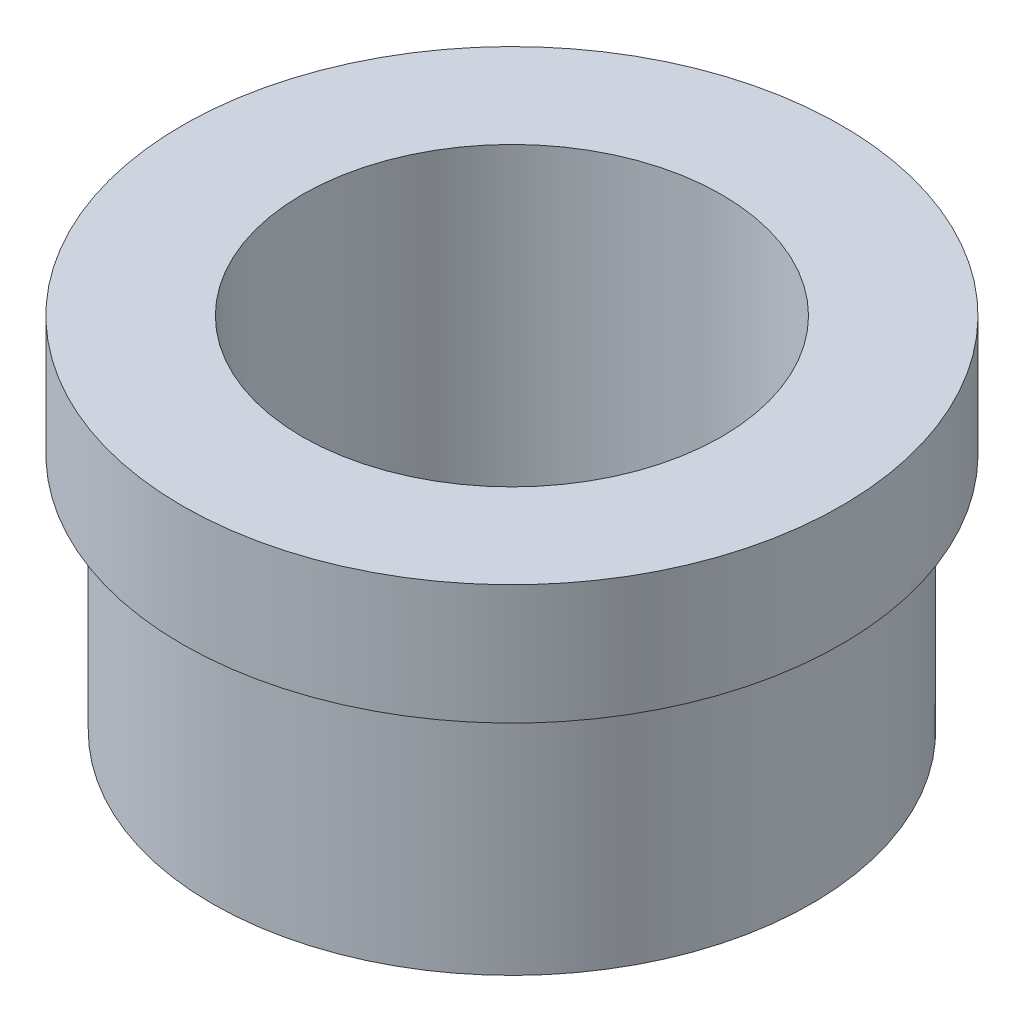
ISO-10303-21;
HEADER;
FILE_DESCRIPTION(('STEP AP214'),'2;1');
FILE_NAME('part.step','',(''),(''),'','','');
FILE_SCHEMA(('AUTOMOTIVE_DESIGN { 1 0 10303 214 1 1 1 1 }'));
ENDSEC;
DATA;
#1=APPLICATION_CONTEXT('core data for automotive mechanical design processes');
#2=APPLICATION_PROTOCOL_DEFINITION('international standard','automotive_design',2000,#1);
#3=PRODUCT_CONTEXT('',#1,'mechanical');
#4=PRODUCT('Part','Part','',(#3));
#5=PRODUCT_RELATED_PRODUCT_CATEGORY('part','',(#4));
#6=PRODUCT_DEFINITION_FORMATION('','',#4);
#7=PRODUCT_DEFINITION_CONTEXT('part definition',#1,'design');
#8=PRODUCT_DEFINITION('design','',#6,#7);
#9=PRODUCT_DEFINITION_SHAPE('','',#8);
#10=(LENGTH_UNIT() NAMED_UNIT(*) SI_UNIT(.MILLI.,.METRE.));
#11=(NAMED_UNIT(*) PLANE_ANGLE_UNIT() SI_UNIT($,.RADIAN.));
#12=(NAMED_UNIT(*) SI_UNIT($,.STERADIAN.) SOLID_ANGLE_UNIT());
#13=UNCERTAINTY_MEASURE_WITH_UNIT(LENGTH_MEASURE(1.E-05),#10,'distance_accuracy_value','');
#14=(GEOMETRIC_REPRESENTATION_CONTEXT(3) GLOBAL_UNCERTAINTY_ASSIGNED_CONTEXT((#13)) GLOBAL_UNIT_ASSIGNED_CONTEXT((#10,
#11,#12)) REPRESENTATION_CONTEXT('',''));
#15=CARTESIAN_POINT('',(0.,0.,0.));
#16=DIRECTION('',(0.,0.,1.));
#17=DIRECTION('',(1.,0.,0.));
#18=AXIS2_PLACEMENT_3D('',#15,#16,#17);
#19=CARTESIAN_POINT('',(0.,0.,0.));
#20=DIRECTION('',(0.,1.,0.));
#21=DIRECTION('',(0.,0.,1.));
#22=AXIS2_PLACEMENT_3D('',#19,#20,#21);
#23=PLANE('',#22);
#24=CARTESIAN_POINT('',(0.,0.,0.));
#25=DIRECTION('',(0.,1.,0.));
#26=DIRECTION('',(0.,0.,1.));
#27=AXIS2_PLACEMENT_3D('',#24,#25,#26);
#28=CIRCLE('',#27,25.);
#29=CARTESIAN_POINT('',(0.,0.,25.));
#30=VERTEX_POINT('',#29);
#31=EDGE_CURVE('E43',#30,#30,#28,.T.);
#32=ORIENTED_EDGE('',*,*,#31,.F.);
#33=EDGE_LOOP('',(#32));
#34=FACE_BOUND('',#33,.T.);
#35=CARTESIAN_POINT('',(0.,0.,0.));
#36=DIRECTION('',(0.,1.,0.));
#37=DIRECTION('',(0.,0.,1.));
#38=AXIS2_PLACEMENT_3D('',#35,#36,#37);
#39=CIRCLE('',#38,17.5);
#40=CARTESIAN_POINT('',(0.,0.,17.5));
#41=VERTEX_POINT('',#40);
#42=EDGE_CURVE('E52',#41,#41,#39,.T.);
#43=ORIENTED_EDGE('',*,*,#42,.T.);
#44=EDGE_LOOP('',(#43));
#45=FACE_BOUND('',#44,.T.);
#46=ADVANCED_FACE('F39',(#34,#45),#23,.F.);
#47=CARTESIAN_POINT('',(0.,20.,0.));
#48=DIRECTION('',(0.,-1.,0.));
#49=DIRECTION('',(0.,0.,-1.));
#50=AXIS2_PLACEMENT_3D('',#47,#48,#49);
#51=CYLINDRICAL_SURFACE('',#50,25.);
#52=CARTESIAN_POINT('',(0.,20.,0.));
#53=DIRECTION('',(0.,1.,0.));
#54=DIRECTION('',(0.,0.,1.));
#55=AXIS2_PLACEMENT_3D('',#52,#53,#54);
#56=CIRCLE('',#55,25.);
#57=CARTESIAN_POINT('',(0.,20.,25.));
#58=VERTEX_POINT('',#57);
#59=EDGE_CURVE('E10',#58,#58,#56,.T.);
#60=ORIENTED_EDGE('',*,*,#59,.F.);
#61=EDGE_LOOP('',(#60));
#62=FACE_BOUND('',#61,.T.);
#63=ORIENTED_EDGE('',*,*,#31,.T.);
#64=EDGE_LOOP('',(#63));
#65=FACE_BOUND('',#64,.T.);
#66=ADVANCED_FACE('F41',(#62,#65),#51,.T.);
#67=CARTESIAN_POINT('',(0.,20.,0.));
#68=DIRECTION('',(0.,-1.,0.));
#69=DIRECTION('',(0.,0.,-1.));
#70=AXIS2_PLACEMENT_3D('',#67,#68,#69);
#71=CYLINDRICAL_SURFACE('',#70,17.5);
#72=ORIENTED_EDGE('',*,*,#42,.F.);
#73=EDGE_LOOP('',(#72));
#74=FACE_BOUND('',#73,.T.);
#75=CARTESIAN_POINT('',(0.,30.,0.));
#76=DIRECTION('',(0.,1.,0.));
#77=DIRECTION('',(0.,0.,1.));
#78=AXIS2_PLACEMENT_3D('',#75,#76,#77);
#79=CIRCLE('',#78,17.5);
#80=CARTESIAN_POINT('',(0.,30.,17.5));
#81=VERTEX_POINT('',#80);
#82=EDGE_CURVE('E62',#81,#81,#79,.T.);
#83=ORIENTED_EDGE('',*,*,#82,.T.);
#84=EDGE_LOOP('',(#83));
#85=FACE_BOUND('',#84,.T.);
#86=ADVANCED_FACE('F70',(#74,#85),#71,.F.);
#87=CARTESIAN_POINT('',(0.,30.,0.));
#88=DIRECTION('',(0.,1.,0.));
#89=DIRECTION('',(0.,0.,1.));
#90=AXIS2_PLACEMENT_3D('',#87,#88,#89);
#91=PLANE('',#90);
#92=CARTESIAN_POINT('',(0.,30.,0.));
#93=DIRECTION('',(0.,1.,0.));
#94=DIRECTION('',(0.,0.,1.));
#95=AXIS2_PLACEMENT_3D('',#92,#93,#94);
#96=CIRCLE('',#95,27.5);
#97=CARTESIAN_POINT('',(0.,30.,27.5));
#98=VERTEX_POINT('',#97);
#99=EDGE_CURVE('E57',#98,#98,#96,.T.);
#100=ORIENTED_EDGE('',*,*,#99,.T.);
#101=EDGE_LOOP('',(#100));
#102=FACE_BOUND('',#101,.T.);
#103=ORIENTED_EDGE('',*,*,#82,.F.);
#104=EDGE_LOOP('',(#103));
#105=FACE_BOUND('',#104,.T.);
#106=ADVANCED_FACE('F72',(#102,#105),#91,.T.);
#107=CARTESIAN_POINT('',(0.,20.,0.));
#108=DIRECTION('',(0.,1.,0.));
#109=DIRECTION('',(0.,0.,1.));
#110=AXIS2_PLACEMENT_3D('',#107,#108,#109);
#111=PLANE('',#110);
#112=ORIENTED_EDGE('',*,*,#59,.T.);
#113=EDGE_LOOP('',(#112));
#114=FACE_BOUND('',#113,.T.);
#115=CARTESIAN_POINT('',(0.,20.,0.));
#116=DIRECTION('',(0.,1.,0.));
#117=DIRECTION('',(0.,0.,1.));
#118=AXIS2_PLACEMENT_3D('',#115,#116,#117);
#119=CIRCLE('',#118,27.5);
#120=CARTESIAN_POINT('',(0.,20.,27.5));
#121=VERTEX_POINT('',#120);
#122=EDGE_CURVE('E58',#121,#121,#119,.T.);
#123=ORIENTED_EDGE('',*,*,#122,.F.);
#124=EDGE_LOOP('',(#123));
#125=FACE_BOUND('',#124,.T.);
#126=ADVANCED_FACE('F74',(#114,#125),#111,.F.);
#127=CARTESIAN_POINT('',(0.,30.,0.));
#128=DIRECTION('',(0.,-1.,0.));
#129=DIRECTION('',(0.,0.,-1.));
#130=AXIS2_PLACEMENT_3D('',#127,#128,#129);
#131=CYLINDRICAL_SURFACE('',#130,27.5);
#132=ORIENTED_EDGE('',*,*,#99,.F.);
#133=EDGE_LOOP('',(#132));
#134=FACE_BOUND('',#133,.T.);
#135=ORIENTED_EDGE('',*,*,#122,.T.);
#136=EDGE_LOOP('',(#135));
#137=FACE_BOUND('',#136,.T.);
#138=ADVANCED_FACE('F81',(#134,#137),#131,.T.);
#139=CLOSED_SHELL('',(#46,#66,#86,#106,#126,#138));
#140=MANIFOLD_SOLID_BREP('B2',#139);
#141=ADVANCED_BREP_SHAPE_REPRESENTATION('',(#18,#140),#14);
#142=SHAPE_DEFINITION_REPRESENTATION(#9,#141);
ENDSEC;
END-ISO-10303-21;
